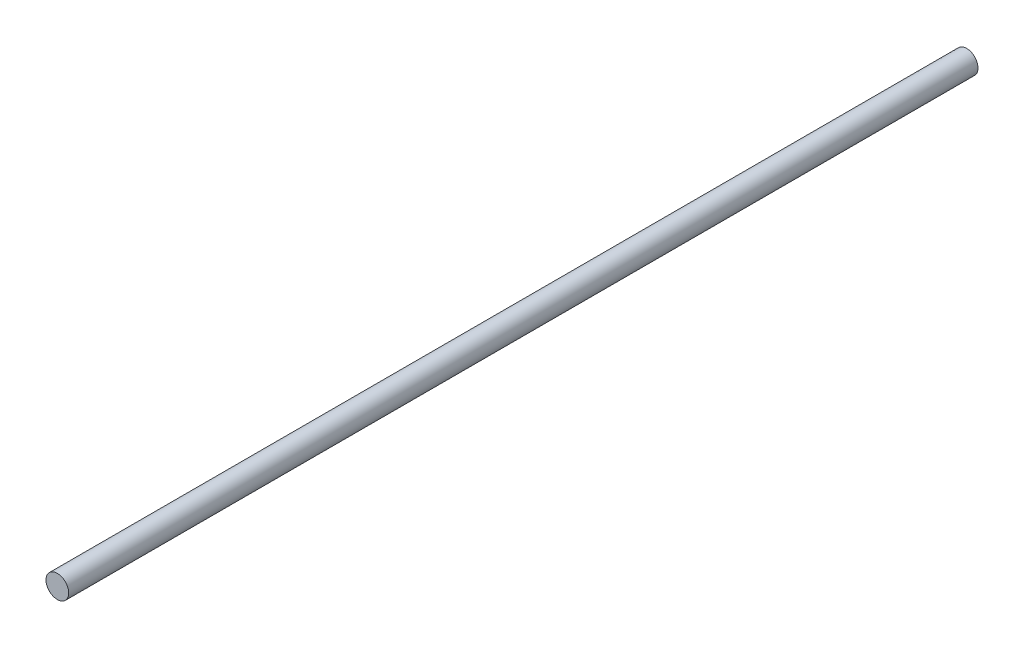
ISO-10303-21;
HEADER;
FILE_DESCRIPTION(('STEP AP214'),'2;1');
FILE_NAME('part.step','',(''),(''),'','','');
FILE_SCHEMA(('AUTOMOTIVE_DESIGN { 1 0 10303 214 1 1 1 1 }'));
ENDSEC;
DATA;
#1=APPLICATION_CONTEXT('core data for automotive mechanical design processes');
#2=APPLICATION_PROTOCOL_DEFINITION('international standard','automotive_design',2000,#1);
#3=PRODUCT_CONTEXT('',#1,'mechanical');
#4=PRODUCT('Part','Part','',(#3));
#5=PRODUCT_RELATED_PRODUCT_CATEGORY('part','',(#4));
#6=PRODUCT_DEFINITION_FORMATION('','',#4);
#7=PRODUCT_DEFINITION_CONTEXT('part definition',#1,'design');
#8=PRODUCT_DEFINITION('design','',#6,#7);
#9=PRODUCT_DEFINITION_SHAPE('','',#8);
#10=(LENGTH_UNIT() NAMED_UNIT(*) SI_UNIT(.MILLI.,.METRE.));
#11=(NAMED_UNIT(*) PLANE_ANGLE_UNIT() SI_UNIT($,.RADIAN.));
#12=(NAMED_UNIT(*) SI_UNIT($,.STERADIAN.) SOLID_ANGLE_UNIT());
#13=UNCERTAINTY_MEASURE_WITH_UNIT(LENGTH_MEASURE(1.E-05),#10,'distance_accuracy_value','');
#14=(GEOMETRIC_REPRESENTATION_CONTEXT(3) GLOBAL_UNCERTAINTY_ASSIGNED_CONTEXT((#13)) GLOBAL_UNIT_ASSIGNED_CONTEXT((#10,
#11,#12)) REPRESENTATION_CONTEXT('',''));
#15=CARTESIAN_POINT('',(0.,0.,0.));
#16=DIRECTION('',(0.,0.,1.));
#17=DIRECTION('',(1.,0.,0.));
#18=AXIS2_PLACEMENT_3D('',#15,#16,#17);
#19=CARTESIAN_POINT('',(0.,0.,400.));
#20=DIRECTION('',(0.,0.,-1.));
#21=DIRECTION('',(-1.,0.,0.));
#22=AXIS2_PLACEMENT_3D('',#19,#20,#21);
#23=CYLINDRICAL_SURFACE('',#22,5.);
#24=CARTESIAN_POINT('',(0.,0.,400.));
#25=DIRECTION('',(0.,0.,1.));
#26=DIRECTION('',(1.,0.,0.));
#27=AXIS2_PLACEMENT_3D('',#24,#25,#26);
#28=CIRCLE('',#27,5.);
#29=CARTESIAN_POINT('',(5.,0.,400.));
#30=VERTEX_POINT('',#29);
#31=EDGE_CURVE('E10',#30,#30,#28,.T.);
#32=ORIENTED_EDGE('',*,*,#31,.F.);
#33=EDGE_LOOP('',(#32));
#34=FACE_BOUND('',#33,.T.);
#35=CARTESIAN_POINT('',(0.,0.,0.));
#36=DIRECTION('',(0.,0.,1.));
#37=DIRECTION('',(1.,0.,0.));
#38=AXIS2_PLACEMENT_3D('',#35,#36,#37);
#39=CIRCLE('',#38,5.);
#40=CARTESIAN_POINT('',(5.,0.,0.));
#41=VERTEX_POINT('',#40);
#42=EDGE_CURVE('E42',#41,#41,#39,.T.);
#43=ORIENTED_EDGE('',*,*,#42,.T.);
#44=EDGE_LOOP('',(#43));
#45=FACE_BOUND('',#44,.T.);
#46=ADVANCED_FACE('F39',(#34,#45),#23,.T.);
#47=CARTESIAN_POINT('',(0.,0.,400.));
#48=DIRECTION('',(0.,0.,1.));
#49=DIRECTION('',(1.,0.,0.));
#50=AXIS2_PLACEMENT_3D('',#47,#48,#49);
#51=PLANE('',#50);
#52=ORIENTED_EDGE('',*,*,#31,.T.);
#53=EDGE_LOOP('',(#52));
#54=FACE_BOUND('',#53,.T.);
#55=ADVANCED_FACE('F56',(#54),#51,.T.);
#56=CARTESIAN_POINT('',(0.,0.,0.));
#57=DIRECTION('',(0.,0.,1.));
#58=DIRECTION('',(1.,0.,0.));
#59=AXIS2_PLACEMENT_3D('',#56,#57,#58);
#60=PLANE('',#59);
#61=ORIENTED_EDGE('',*,*,#42,.F.);
#62=EDGE_LOOP('',(#61));
#63=FACE_BOUND('',#62,.T.);
#64=ADVANCED_FACE('F54',(#63),#60,.F.);
#65=CLOSED_SHELL('',(#46,#55,#64));
#66=MANIFOLD_SOLID_BREP('B2',#65);
#67=ADVANCED_BREP_SHAPE_REPRESENTATION('',(#18,#66),#14);
#68=SHAPE_DEFINITION_REPRESENTATION(#9,#67);
ENDSEC;
END-ISO-10303-21;
